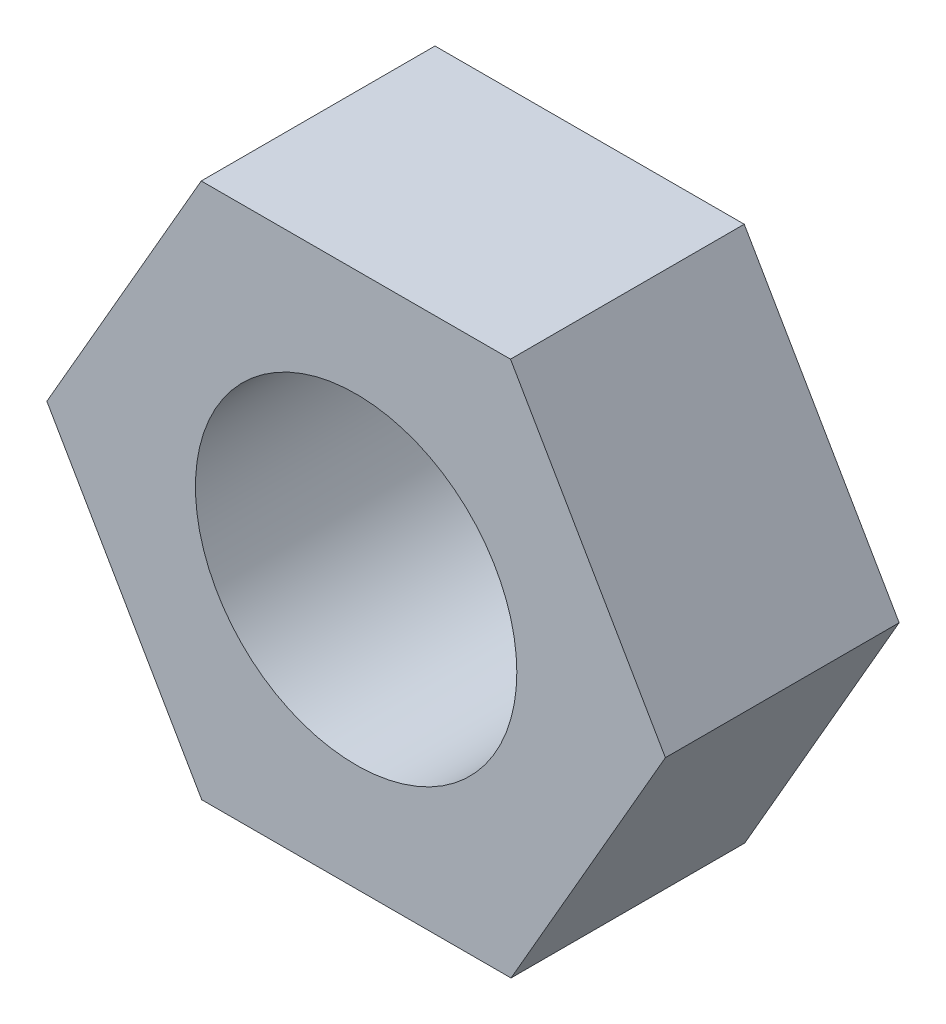
ISO-10303-21;
HEADER;
FILE_DESCRIPTION(('STEP AP214'),'2;1');
FILE_NAME('part.step','',(''),(''),'','','');
FILE_SCHEMA(('AUTOMOTIVE_DESIGN { 1 0 10303 214 1 1 1 1 }'));
ENDSEC;
DATA;
#1=APPLICATION_CONTEXT('core data for automotive mechanical design processes');
#2=APPLICATION_PROTOCOL_DEFINITION('international standard','automotive_design',2000,#1);
#3=PRODUCT_CONTEXT('',#1,'mechanical');
#4=PRODUCT('Part','Part','',(#3));
#5=PRODUCT_RELATED_PRODUCT_CATEGORY('part','',(#4));
#6=PRODUCT_DEFINITION_FORMATION('','',#4);
#7=PRODUCT_DEFINITION_CONTEXT('part definition',#1,'design');
#8=PRODUCT_DEFINITION('design','',#6,#7);
#9=PRODUCT_DEFINITION_SHAPE('','',#8);
#10=(LENGTH_UNIT() NAMED_UNIT(*) SI_UNIT(.MILLI.,.METRE.));
#11=(NAMED_UNIT(*) PLANE_ANGLE_UNIT() SI_UNIT($,.RADIAN.));
#12=(NAMED_UNIT(*) SI_UNIT($,.STERADIAN.) SOLID_ANGLE_UNIT());
#13=UNCERTAINTY_MEASURE_WITH_UNIT(LENGTH_MEASURE(1.E-05),#10,'distance_accuracy_value','');
#14=(GEOMETRIC_REPRESENTATION_CONTEXT(3) GLOBAL_UNCERTAINTY_ASSIGNED_CONTEXT((#13)) GLOBAL_UNIT_ASSIGNED_CONTEXT((#10,
#11,#12)) REPRESENTATION_CONTEXT('',''));
#15=CARTESIAN_POINT('',(0.,0.,0.));
#16=DIRECTION('',(0.,0.,1.));
#17=DIRECTION('',(1.,0.,0.));
#18=AXIS2_PLACEMENT_3D('',#15,#16,#17);
#19=CARTESIAN_POINT('',(3.1754249756834,0.00309146234576668,2.4));
#20=DIRECTION('',(-0.865538214290694,-0.500842889140374,0.));
#21=DIRECTION('',(0.500842889140374,-0.865538214290694,0.));
#22=AXIS2_PLACEMENT_3D('',#19,#20,#21);
#23=PLANE('',#22);
#24=DIRECTION('',(-0.500842889140374,0.865538214290694,0.));
#25=VECTOR('',#24,1.);
#26=CARTESIAN_POINT('',(3.1754249756834,0.00309146234576668,0.));
#27=LINE('',#26,#25);
#28=CARTESIAN_POINT('',(3.1754249756834,0.00309146234576668,0.));
#29=VERTEX_POINT('',#28);
#30=CARTESIAN_POINT('',(1.58503520291542,2.75154442792629,0.));
#31=VERTEX_POINT('',#30);
#32=EDGE_CURVE('E116',#29,#31,#27,.T.);
#33=ORIENTED_EDGE('',*,*,#32,.T.);
#34=DIRECTION('',(0.,0.,-1.));
#35=VECTOR('',#34,1.);
#36=CARTESIAN_POINT('',(1.58503520291542,2.75154442792629,2.4));
#37=LINE('',#36,#35);
#38=CARTESIAN_POINT('',(1.58503520291542,2.75154442792629,2.4));
#39=VERTEX_POINT('',#38);
#40=EDGE_CURVE('E11',#39,#31,#37,.T.);
#41=ORIENTED_EDGE('',*,*,#40,.F.);
#42=DIRECTION('',(-0.500842889140374,0.865538214290694,0.));
#43=VECTOR('',#42,1.);
#44=CARTESIAN_POINT('',(3.1754249756834,0.00309146234576668,2.4));
#45=LINE('',#44,#43);
#46=CARTESIAN_POINT('',(3.1754249756834,0.00309146234576668,2.4));
#47=VERTEX_POINT('',#46);
#48=EDGE_CURVE('E127',#47,#39,#45,.T.);
#49=ORIENTED_EDGE('',*,*,#48,.F.);
#50=DIRECTION('',(0.,0.,-1.));
#51=VECTOR('',#50,1.);
#52=CARTESIAN_POINT('',(3.1754249756834,0.00309146234576668,2.4));
#53=LINE('',#52,#51);
#54=EDGE_CURVE('E112',#47,#29,#53,.T.);
#55=ORIENTED_EDGE('',*,*,#54,.T.);
#56=EDGE_LOOP('',(#33,#41,#49,#55));
#57=FACE_BOUND('',#56,.T.);
#58=ADVANCED_FACE('F32',(#57),#23,.F.);
#59=CARTESIAN_POINT('',(1.58503520291542,2.75154442792629,2.4));
#60=DIRECTION('',(0.000973558155009883,-0.999999526092147,0.));
#61=DIRECTION('',(0.999999526092147,0.000973558155009883,0.));
#62=AXIS2_PLACEMENT_3D('',#59,#60,#61);
#63=PLANE('',#62);
#64=DIRECTION('',(-0.999999526092147,-0.000973558155009883,0.));
#65=VECTOR('',#64,1.);
#66=CARTESIAN_POINT('',(1.58503520291542,2.75154442792629,0.));
#67=LINE('',#66,#65);
#68=CARTESIAN_POINT('',(-1.59038977276797,2.74845296558052,0.));
#69=VERTEX_POINT('',#68);
#70=EDGE_CURVE('E119',#31,#69,#67,.T.);
#71=ORIENTED_EDGE('',*,*,#70,.T.);
#72=DIRECTION('',(0.,0.,-1.));
#73=VECTOR('',#72,1.);
#74=CARTESIAN_POINT('',(-1.59038977276797,2.74845296558052,2.4));
#75=LINE('',#74,#73);
#76=CARTESIAN_POINT('',(-1.59038977276797,2.74845296558052,2.4));
#77=VERTEX_POINT('',#76);
#78=EDGE_CURVE('E40',#77,#69,#75,.T.);
#79=ORIENTED_EDGE('',*,*,#78,.F.);
#80=DIRECTION('',(-0.999999526092147,-0.000973558155009883,0.));
#81=VECTOR('',#80,1.);
#82=CARTESIAN_POINT('',(1.58503520291542,2.75154442792629,2.4));
#83=LINE('',#82,#81);
#84=EDGE_CURVE('E85',#39,#77,#83,.T.);
#85=ORIENTED_EDGE('',*,*,#84,.F.);
#86=ORIENTED_EDGE('',*,*,#40,.T.);
#87=EDGE_LOOP('',(#71,#79,#85,#86));
#88=FACE_BOUND('',#87,.T.);
#89=ADVANCED_FACE('F152',(#88),#63,.F.);
#90=CARTESIAN_POINT('',(-1.59038977276797,2.74845296558052,2.4));
#91=DIRECTION('',(0.866511772445704,-0.499156636951773,0.));
#92=DIRECTION('',(0.499156636951773,0.866511772445704,0.));
#93=AXIS2_PLACEMENT_3D('',#90,#91,#92);
#94=PLANE('',#93);
#95=DIRECTION('',(-0.499156636951773,-0.866511772445704,0.));
#96=VECTOR('',#95,1.);
#97=CARTESIAN_POINT('',(-1.59038977276797,2.74845296558052,0.));
#98=LINE('',#97,#96);
#99=CARTESIAN_POINT('',(-3.1754249756834,-0.00309146234576791,0.));
#100=VERTEX_POINT('',#99);
#101=EDGE_CURVE('E122',#69,#100,#98,.T.);
#102=ORIENTED_EDGE('',*,*,#101,.T.);
#103=DIRECTION('',(0.,0.,-1.));
#104=VECTOR('',#103,1.);
#105=CARTESIAN_POINT('',(-3.1754249756834,-0.00309146234576791,2.4));
#106=LINE('',#105,#104);
#107=CARTESIAN_POINT('',(-3.1754249756834,-0.00309146234576791,2.4));
#108=VERTEX_POINT('',#107);
#109=EDGE_CURVE('E107',#108,#100,#106,.T.);
#110=ORIENTED_EDGE('',*,*,#109,.F.);
#111=DIRECTION('',(-0.499156636951773,-0.866511772445704,0.));
#112=VECTOR('',#111,1.);
#113=CARTESIAN_POINT('',(-1.59038977276797,2.74845296558052,2.4));
#114=LINE('',#113,#112);
#115=EDGE_CURVE('E98',#77,#108,#114,.T.);
#116=ORIENTED_EDGE('',*,*,#115,.F.);
#117=ORIENTED_EDGE('',*,*,#78,.T.);
#118=EDGE_LOOP('',(#102,#110,#116,#117));
#119=FACE_BOUND('',#118,.T.);
#120=ADVANCED_FACE('F133',(#119),#94,.F.);
#121=CARTESIAN_POINT('',(-3.1754249756834,-0.00309146234576791,2.4));
#122=DIRECTION('',(0.865538214290694,0.500842889140374,0.));
#123=DIRECTION('',(-0.500842889140374,0.865538214290694,0.));
#124=AXIS2_PLACEMENT_3D('',#121,#122,#123);
#125=PLANE('',#124);
#126=DIRECTION('',(0.500842889140373,-0.865538214290694,0.));
#127=VECTOR('',#126,1.);
#128=CARTESIAN_POINT('',(-3.1754249756834,-0.00309146234576791,0.));
#129=LINE('',#128,#127);
#130=CARTESIAN_POINT('',(-1.58503520291542,-2.75154442792629,0.));
#131=VERTEX_POINT('',#130);
#132=EDGE_CURVE('E106',#100,#131,#129,.T.);
#133=ORIENTED_EDGE('',*,*,#132,.T.);
#134=DIRECTION('',(0.,0.,-1.));
#135=VECTOR('',#134,1.);
#136=CARTESIAN_POINT('',(-1.58503520291542,-2.75154442792629,2.4));
#137=LINE('',#136,#135);
#138=CARTESIAN_POINT('',(-1.58503520291542,-2.75154442792629,2.4));
#139=VERTEX_POINT('',#138);
#140=EDGE_CURVE('E103',#139,#131,#137,.T.);
#141=ORIENTED_EDGE('',*,*,#140,.F.);
#142=DIRECTION('',(0.500842889140373,-0.865538214290694,0.));
#143=VECTOR('',#142,1.);
#144=CARTESIAN_POINT('',(-3.1754249756834,-0.00309146234576791,2.4));
#145=LINE('',#144,#143);
#146=EDGE_CURVE('E92',#108,#139,#145,.T.);
#147=ORIENTED_EDGE('',*,*,#146,.F.);
#148=ORIENTED_EDGE('',*,*,#109,.T.);
#149=EDGE_LOOP('',(#133,#141,#147,#148));
#150=FACE_BOUND('',#149,.T.);
#151=ADVANCED_FACE('F104',(#150),#125,.F.);
#152=CARTESIAN_POINT('',(-1.58503520291542,-2.75154442792629,2.4));
#153=DIRECTION('',(-0.00097355815501002,0.999999526092147,0.));
#154=DIRECTION('',(-0.999999526092147,-0.00097355815501002,0.));
#155=AXIS2_PLACEMENT_3D('',#152,#153,#154);
#156=PLANE('',#155);
#157=DIRECTION('',(0.999999526092147,0.00097355815501002,0.));
#158=VECTOR('',#157,1.);
#159=CARTESIAN_POINT('',(-1.58503520291542,-2.75154442792629,0.));
#160=LINE('',#159,#158);
#161=CARTESIAN_POINT('',(1.59038977276797,-2.74845296558052,0.));
#162=VERTEX_POINT('',#161);
#163=EDGE_CURVE('E71',#131,#162,#160,.T.);
#164=ORIENTED_EDGE('',*,*,#163,.T.);
#165=DIRECTION('',(0.,0.,-1.));
#166=VECTOR('',#165,1.);
#167=CARTESIAN_POINT('',(1.59038977276797,-2.74845296558052,2.4));
#168=LINE('',#167,#166);
#169=CARTESIAN_POINT('',(1.59038977276797,-2.74845296558052,2.4));
#170=VERTEX_POINT('',#169);
#171=EDGE_CURVE('E108',#170,#162,#168,.T.);
#172=ORIENTED_EDGE('',*,*,#171,.F.);
#173=DIRECTION('',(0.999999526092147,0.00097355815501002,0.));
#174=VECTOR('',#173,1.);
#175=CARTESIAN_POINT('',(-1.58503520291542,-2.75154442792629,2.4));
#176=LINE('',#175,#174);
#177=EDGE_CURVE('E96',#139,#170,#176,.T.);
#178=ORIENTED_EDGE('',*,*,#177,.F.);
#179=ORIENTED_EDGE('',*,*,#140,.T.);
#180=EDGE_LOOP('',(#164,#172,#178,#179));
#181=FACE_BOUND('',#180,.T.);
#182=ADVANCED_FACE('F110',(#181),#156,.F.);
#183=CARTESIAN_POINT('',(1.59038977276797,-2.74845296558052,2.4));
#184=DIRECTION('',(-0.866511772445704,0.499156636951774,0.));
#185=DIRECTION('',(-0.499156636951774,-0.866511772445704,0.));
#186=AXIS2_PLACEMENT_3D('',#183,#184,#185);
#187=PLANE('',#186);
#188=DIRECTION('',(0.499156636951774,0.866511772445704,0.));
#189=VECTOR('',#188,1.);
#190=CARTESIAN_POINT('',(1.59038977276797,-2.74845296558052,0.));
#191=LINE('',#190,#189);
#192=EDGE_CURVE('E77',#162,#29,#191,.T.);
#193=ORIENTED_EDGE('',*,*,#192,.T.);
#194=ORIENTED_EDGE('',*,*,#54,.F.);
#195=DIRECTION('',(0.499156636951774,0.866511772445704,0.));
#196=VECTOR('',#195,1.);
#197=CARTESIAN_POINT('',(1.59038977276797,-2.74845296558052,2.4));
#198=LINE('',#197,#196);
#199=EDGE_CURVE('E48',#170,#47,#198,.T.);
#200=ORIENTED_EDGE('',*,*,#199,.F.);
#201=ORIENTED_EDGE('',*,*,#171,.T.);
#202=EDGE_LOOP('',(#193,#194,#200,#201));
#203=FACE_BOUND('',#202,.T.);
#204=ADVANCED_FACE('F140',(#203),#187,.F.);
#205=CARTESIAN_POINT('',(0.,0.,2.4));
#206=DIRECTION('',(0.,0.,1.));
#207=DIRECTION('',(1.,0.,0.));
#208=AXIS2_PLACEMENT_3D('',#205,#206,#207);
#209=PLANE('',#208);
#210=CARTESIAN_POINT('',(0.,0.,2.4));
#211=DIRECTION('',(0.,0.,1.));
#212=DIRECTION('',(1.,0.,0.));
#213=AXIS2_PLACEMENT_3D('',#210,#211,#212);
#214=CIRCLE('',#213,1.65);
#215=CARTESIAN_POINT('',(1.65,0.,2.4));
#216=VERTEX_POINT('',#215);
#217=EDGE_CURVE('E207',#216,#216,#214,.T.);
#218=ORIENTED_EDGE('',*,*,#217,.F.);
#219=EDGE_LOOP('',(#218));
#220=FACE_BOUND('',#219,.T.);
#221=ORIENTED_EDGE('',*,*,#48,.T.);
#222=ORIENTED_EDGE('',*,*,#84,.T.);
#223=ORIENTED_EDGE('',*,*,#115,.T.);
#224=ORIENTED_EDGE('',*,*,#146,.T.);
#225=ORIENTED_EDGE('',*,*,#177,.T.);
#226=ORIENTED_EDGE('',*,*,#199,.T.);
#227=EDGE_LOOP('',(#221,#222,#223,#224,#225,#226));
#228=FACE_BOUND('',#227,.T.);
#229=ADVANCED_FACE('F94',(#220,#228),#209,.T.);
#230=CARTESIAN_POINT('',(0.,0.,0.));
#231=DIRECTION('',(0.,0.,1.));
#232=DIRECTION('',(1.,0.,0.));
#233=AXIS2_PLACEMENT_3D('',#230,#231,#232);
#234=PLANE('',#233);
#235=CARTESIAN_POINT('',(0.,0.,0.));
#236=DIRECTION('',(0.,0.,1.));
#237=DIRECTION('',(1.,0.,0.));
#238=AXIS2_PLACEMENT_3D('',#235,#236,#237);
#239=CIRCLE('',#238,1.65);
#240=CARTESIAN_POINT('',(1.65,0.,0.));
#241=VERTEX_POINT('',#240);
#242=EDGE_CURVE('E120',#241,#241,#239,.T.);
#243=ORIENTED_EDGE('',*,*,#242,.T.);
#244=EDGE_LOOP('',(#243));
#245=FACE_BOUND('',#244,.T.);
#246=ORIENTED_EDGE('',*,*,#32,.F.);
#247=ORIENTED_EDGE('',*,*,#192,.F.);
#248=ORIENTED_EDGE('',*,*,#163,.F.);
#249=ORIENTED_EDGE('',*,*,#132,.F.);
#250=ORIENTED_EDGE('',*,*,#101,.F.);
#251=ORIENTED_EDGE('',*,*,#70,.F.);
#252=EDGE_LOOP('',(#246,#247,#248,#249,#250,#251));
#253=FACE_BOUND('',#252,.T.);
#254=ADVANCED_FACE('F136',(#245,#253),#234,.F.);
#255=CARTESIAN_POINT('',(0.,0.,0.));
#256=DIRECTION('',(0.,0.,1.));
#257=DIRECTION('',(1.,0.,0.));
#258=AXIS2_PLACEMENT_3D('',#255,#256,#257);
#259=CYLINDRICAL_SURFACE('',#258,1.65);
#260=ORIENTED_EDGE('',*,*,#242,.F.);
#261=EDGE_LOOP('',(#260));
#262=FACE_BOUND('',#261,.T.);
#263=ORIENTED_EDGE('',*,*,#217,.T.);
#264=EDGE_LOOP('',(#263));
#265=FACE_BOUND('',#264,.T.);
#266=ADVANCED_FACE('F189',(#262,#265),#259,.F.);
#267=CLOSED_SHELL('',(#58,#89,#120,#151,#182,#204,#229,#254,#266));
#268=MANIFOLD_SOLID_BREP('B2',#267);
#269=ADVANCED_BREP_SHAPE_REPRESENTATION('',(#18,#268),#14);
#270=SHAPE_DEFINITION_REPRESENTATION(#9,#269);
ENDSEC;
END-ISO-10303-21;
